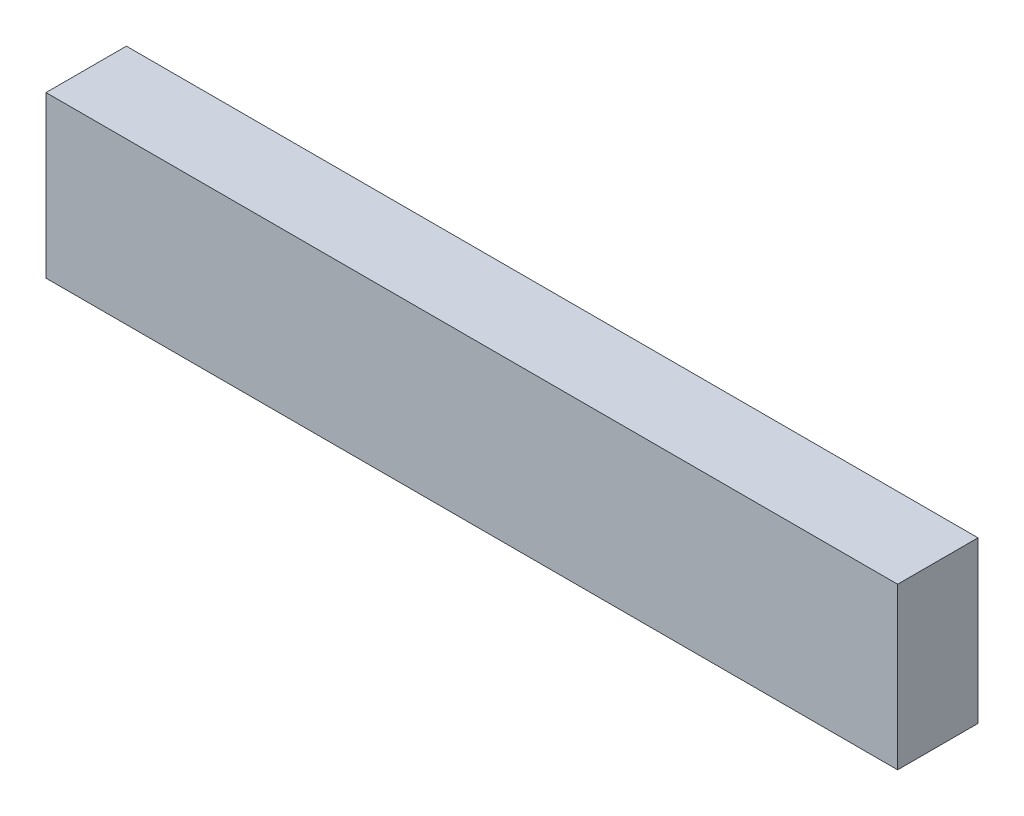
ISO-10303-21;
HEADER;
FILE_DESCRIPTION(('STEP AP214'),'2;1');
FILE_NAME('part.step','',(''),(''),'','','');
FILE_SCHEMA(('AUTOMOTIVE_DESIGN { 1 0 10303 214 1 1 1 1 }'));
ENDSEC;
DATA;
#1=APPLICATION_CONTEXT('core data for automotive mechanical design processes');
#2=APPLICATION_PROTOCOL_DEFINITION('international standard','automotive_design',2000,#1);
#3=PRODUCT_CONTEXT('',#1,'mechanical');
#4=PRODUCT('Part','Part','',(#3));
#5=PRODUCT_RELATED_PRODUCT_CATEGORY('part','',(#4));
#6=PRODUCT_DEFINITION_FORMATION('','',#4);
#7=PRODUCT_DEFINITION_CONTEXT('part definition',#1,'design');
#8=PRODUCT_DEFINITION('design','',#6,#7);
#9=PRODUCT_DEFINITION_SHAPE('','',#8);
#10=(LENGTH_UNIT() NAMED_UNIT(*) SI_UNIT(.MILLI.,.METRE.));
#11=(NAMED_UNIT(*) PLANE_ANGLE_UNIT() SI_UNIT($,.RADIAN.));
#12=(NAMED_UNIT(*) SI_UNIT($,.STERADIAN.) SOLID_ANGLE_UNIT());
#13=UNCERTAINTY_MEASURE_WITH_UNIT(LENGTH_MEASURE(1.E-05),#10,'distance_accuracy_value','');
#14=(GEOMETRIC_REPRESENTATION_CONTEXT(3) GLOBAL_UNCERTAINTY_ASSIGNED_CONTEXT((#13)) GLOBAL_UNIT_ASSIGNED_CONTEXT((#10,
#11,#12)) REPRESENTATION_CONTEXT('',''));
#15=CARTESIAN_POINT('',(0.,0.,0.));
#16=DIRECTION('',(0.,0.,1.));
#17=DIRECTION('',(1.,0.,0.));
#18=AXIS2_PLACEMENT_3D('',#15,#16,#17);
#19=CARTESIAN_POINT('',(-25.6490196078431,21.4156862745098,19.05));
#20=DIRECTION('',(1.,0.,0.));
#21=DIRECTION('',(0.,0.,-1.));
#22=AXIS2_PLACEMENT_3D('',#19,#20,#21);
#23=PLANE('',#22);
#24=DIRECTION('',(0.,-1.,0.));
#25=VECTOR('',#24,1.);
#26=CARTESIAN_POINT('',(-25.6490196078431,21.4156862745098,0.));
#27=LINE('',#26,#25);
#28=CARTESIAN_POINT('',(-25.6490196078431,21.4156862745098,0.));
#29=VERTEX_POINT('',#28);
#30=CARTESIAN_POINT('',(-25.6490196078431,-16.6843137254902,0.));
#31=VERTEX_POINT('',#30);
#32=EDGE_CURVE('E107',#29,#31,#27,.T.);
#33=ORIENTED_EDGE('',*,*,#32,.T.);
#34=DIRECTION('',(0.,0.,-1.));
#35=VECTOR('',#34,1.);
#36=CARTESIAN_POINT('',(-25.6490196078431,-16.6843137254902,19.05));
#37=LINE('',#36,#35);
#38=CARTESIAN_POINT('',(-25.6490196078431,-16.6843137254902,19.05));
#39=VERTEX_POINT('',#38);
#40=EDGE_CURVE('E11',#39,#31,#37,.T.);
#41=ORIENTED_EDGE('',*,*,#40,.F.);
#42=DIRECTION('',(0.,-1.,0.));
#43=VECTOR('',#42,1.);
#44=CARTESIAN_POINT('',(-25.6490196078431,21.4156862745098,19.05));
#45=LINE('',#44,#43);
#46=CARTESIAN_POINT('',(-25.6490196078431,21.4156862745098,19.05));
#47=VERTEX_POINT('',#46);
#48=EDGE_CURVE('E91',#47,#39,#45,.T.);
#49=ORIENTED_EDGE('',*,*,#48,.F.);
#50=DIRECTION('',(0.,0.,-1.));
#51=VECTOR('',#50,1.);
#52=CARTESIAN_POINT('',(-25.6490196078431,21.4156862745098,19.05));
#53=LINE('',#52,#51);
#54=EDGE_CURVE('E103',#47,#29,#53,.T.);
#55=ORIENTED_EDGE('',*,*,#54,.T.);
#56=EDGE_LOOP('',(#33,#41,#49,#55));
#57=FACE_BOUND('',#56,.T.);
#58=ADVANCED_FACE('F39',(#57),#23,.F.);
#59=CARTESIAN_POINT('',(-25.6490196078431,-16.6843137254902,19.05));
#60=DIRECTION('',(0.,1.,0.));
#61=DIRECTION('',(0.,0.,1.));
#62=AXIS2_PLACEMENT_3D('',#59,#60,#61);
#63=PLANE('',#62);
#64=DIRECTION('',(1.,0.,0.));
#65=VECTOR('',#64,1.);
#66=CARTESIAN_POINT('',(-25.6490196078431,-16.6843137254902,0.));
#67=LINE('',#66,#65);
#68=CARTESIAN_POINT('',(176.179380392157,-16.6843137254902,0.));
#69=VERTEX_POINT('',#68);
#70=EDGE_CURVE('E96',#31,#69,#67,.T.);
#71=ORIENTED_EDGE('',*,*,#70,.T.);
#72=DIRECTION('',(0.,0.,-1.));
#73=VECTOR('',#72,1.);
#74=CARTESIAN_POINT('',(176.179380392157,-16.6843137254902,19.05));
#75=LINE('',#74,#73);
#76=CARTESIAN_POINT('',(176.179380392157,-16.6843137254902,19.05));
#77=VERTEX_POINT('',#76);
#78=EDGE_CURVE('E48',#77,#69,#75,.T.);
#79=ORIENTED_EDGE('',*,*,#78,.F.);
#80=DIRECTION('',(1.,0.,0.));
#81=VECTOR('',#80,1.);
#82=CARTESIAN_POINT('',(-25.6490196078431,-16.6843137254902,19.05));
#83=LINE('',#82,#81);
#84=EDGE_CURVE('E86',#39,#77,#83,.T.);
#85=ORIENTED_EDGE('',*,*,#84,.F.);
#86=ORIENTED_EDGE('',*,*,#40,.T.);
#87=EDGE_LOOP('',(#71,#79,#85,#86));
#88=FACE_BOUND('',#87,.T.);
#89=ADVANCED_FACE('F95',(#88),#63,.F.);
#90=CARTESIAN_POINT('',(176.179380392157,21.4156862745098,19.05));
#91=DIRECTION('',(-1.,0.,0.));
#92=DIRECTION('',(0.,0.,1.));
#93=AXIS2_PLACEMENT_3D('',#90,#91,#92);
#94=PLANE('',#93);
#95=DIRECTION('',(0.,1.,0.));
#96=VECTOR('',#95,1.);
#97=CARTESIAN_POINT('',(176.179380392157,21.4156862745098,0.));
#98=LINE('',#97,#96);
#99=CARTESIAN_POINT('',(176.179380392157,21.4156862745098,0.));
#100=VERTEX_POINT('',#99);
#101=EDGE_CURVE('E73',#69,#100,#98,.T.);
#102=ORIENTED_EDGE('',*,*,#101,.T.);
#103=DIRECTION('',(0.,0.,-1.));
#104=VECTOR('',#103,1.);
#105=CARTESIAN_POINT('',(176.179380392157,21.4156862745098,19.05));
#106=LINE('',#105,#104);
#107=CARTESIAN_POINT('',(176.179380392157,21.4156862745098,19.05));
#108=VERTEX_POINT('',#107);
#109=EDGE_CURVE('E98',#108,#100,#106,.T.);
#110=ORIENTED_EDGE('',*,*,#109,.F.);
#111=DIRECTION('',(0.,1.,0.));
#112=VECTOR('',#111,1.);
#113=CARTESIAN_POINT('',(176.179380392157,21.4156862745098,19.05));
#114=LINE('',#113,#112);
#115=EDGE_CURVE('E89',#77,#108,#114,.T.);
#116=ORIENTED_EDGE('',*,*,#115,.F.);
#117=ORIENTED_EDGE('',*,*,#78,.T.);
#118=EDGE_LOOP('',(#102,#110,#116,#117));
#119=FACE_BOUND('',#118,.T.);
#120=ADVANCED_FACE('F99',(#119),#94,.F.);
#121=CARTESIAN_POINT('',(-25.6490196078431,21.4156862745098,19.05));
#122=DIRECTION('',(0.,-1.,0.));
#123=DIRECTION('',(0.,0.,-1.));
#124=AXIS2_PLACEMENT_3D('',#121,#122,#123);
#125=PLANE('',#124);
#126=DIRECTION('',(-1.,0.,0.));
#127=VECTOR('',#126,1.);
#128=CARTESIAN_POINT('',(-25.6490196078431,21.4156862745098,0.));
#129=LINE('',#128,#127);
#130=EDGE_CURVE('E79',#100,#29,#129,.T.);
#131=ORIENTED_EDGE('',*,*,#130,.T.);
#132=ORIENTED_EDGE('',*,*,#54,.F.);
#133=DIRECTION('',(-1.,0.,0.));
#134=VECTOR('',#133,1.);
#135=CARTESIAN_POINT('',(-25.6490196078431,21.4156862745098,19.05));
#136=LINE('',#135,#134);
#137=EDGE_CURVE('E56',#108,#47,#136,.T.);
#138=ORIENTED_EDGE('',*,*,#137,.F.);
#139=ORIENTED_EDGE('',*,*,#109,.T.);
#140=EDGE_LOOP('',(#131,#132,#138,#139));
#141=FACE_BOUND('',#140,.T.);
#142=ADVANCED_FACE('F120',(#141),#125,.F.);
#143=CARTESIAN_POINT('',(0.,0.,19.05));
#144=DIRECTION('',(0.,0.,1.));
#145=DIRECTION('',(1.,0.,0.));
#146=AXIS2_PLACEMENT_3D('',#143,#144,#145);
#147=PLANE('',#146);
#148=ORIENTED_EDGE('',*,*,#48,.T.);
#149=ORIENTED_EDGE('',*,*,#84,.T.);
#150=ORIENTED_EDGE('',*,*,#115,.T.);
#151=ORIENTED_EDGE('',*,*,#137,.T.);
#152=EDGE_LOOP('',(#148,#149,#150,#151));
#153=FACE_BOUND('',#152,.T.);
#154=ADVANCED_FACE('F87',(#153),#147,.T.);
#155=CARTESIAN_POINT('',(0.,0.,0.));
#156=DIRECTION('',(0.,0.,1.));
#157=DIRECTION('',(1.,0.,0.));
#158=AXIS2_PLACEMENT_3D('',#155,#156,#157);
#159=PLANE('',#158);
#160=ORIENTED_EDGE('',*,*,#32,.F.);
#161=ORIENTED_EDGE('',*,*,#130,.F.);
#162=ORIENTED_EDGE('',*,*,#101,.F.);
#163=ORIENTED_EDGE('',*,*,#70,.F.);
#164=EDGE_LOOP('',(#160,#161,#162,#163));
#165=FACE_BOUND('',#164,.T.);
#166=ADVANCED_FACE('F123',(#165),#159,.F.);
#167=CLOSED_SHELL('',(#58,#89,#120,#142,#154,#166));
#168=MANIFOLD_SOLID_BREP('B2',#167);
#169=ADVANCED_BREP_SHAPE_REPRESENTATION('',(#18,#168),#14);
#170=SHAPE_DEFINITION_REPRESENTATION(#9,#169);
ENDSEC;
END-ISO-10303-21;
